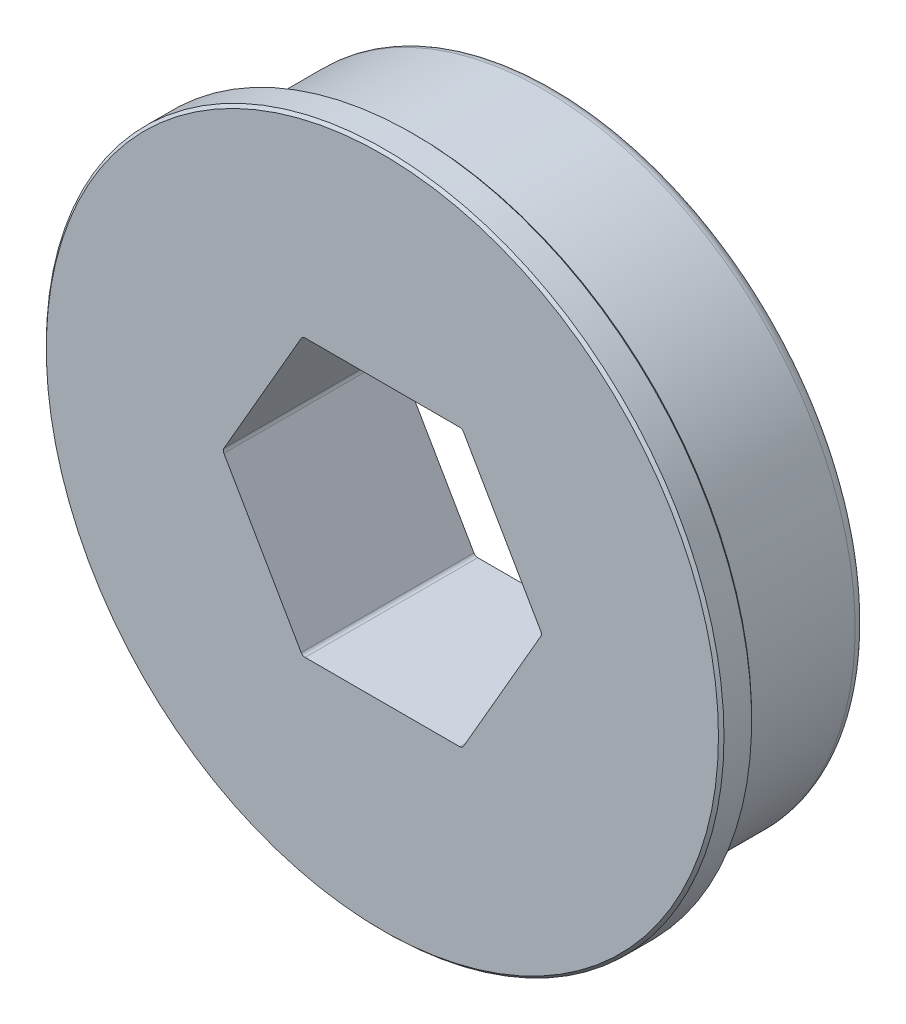
ISO-10303-21;
HEADER;
FILE_DESCRIPTION(('STEP AP214'),'2;1');
FILE_NAME('part.step','',(''),(''),'','','');
FILE_SCHEMA(('AUTOMOTIVE_DESIGN { 1 0 10303 214 1 1 1 1 }'));
ENDSEC;
DATA;
#1=APPLICATION_CONTEXT('core data for automotive mechanical design processes');
#2=APPLICATION_PROTOCOL_DEFINITION('international standard','automotive_design',2000,#1);
#3=PRODUCT_CONTEXT('',#1,'mechanical');
#4=PRODUCT('Part','Part','',(#3));
#5=PRODUCT_RELATED_PRODUCT_CATEGORY('part','',(#4));
#6=PRODUCT_DEFINITION_FORMATION('','',#4);
#7=PRODUCT_DEFINITION_CONTEXT('part definition',#1,'design');
#8=PRODUCT_DEFINITION('design','',#6,#7);
#9=PRODUCT_DEFINITION_SHAPE('','',#8);
#10=(LENGTH_UNIT() NAMED_UNIT(*) SI_UNIT(.MILLI.,.METRE.));
#11=(NAMED_UNIT(*) PLANE_ANGLE_UNIT() SI_UNIT($,.RADIAN.));
#12=(NAMED_UNIT(*) SI_UNIT($,.STERADIAN.) SOLID_ANGLE_UNIT());
#13=UNCERTAINTY_MEASURE_WITH_UNIT(LENGTH_MEASURE(1.E-05),#10,'distance_accuracy_value','');
#14=(GEOMETRIC_REPRESENTATION_CONTEXT(3) GLOBAL_UNCERTAINTY_ASSIGNED_CONTEXT((#13)) GLOBAL_UNIT_ASSIGNED_CONTEXT((#10,
#11,#12)) REPRESENTATION_CONTEXT('',''));
#15=CARTESIAN_POINT('',(0.,0.,0.));
#16=DIRECTION('',(0.,0.,1.));
#17=DIRECTION('',(1.,0.,0.));
#18=AXIS2_PLACEMENT_3D('',#15,#16,#17);
#19=CARTESIAN_POINT('',(0.,0.,7.92734));
#20=DIRECTION('',(0.,0.,-1.));
#21=DIRECTION('',(-1.,0.,0.));
#22=AXIS2_PLACEMENT_3D('',#19,#20,#21);
#23=CYLINDRICAL_SURFACE('',#22,15.5575);
#24=CARTESIAN_POINT('',(0.,0.,7.80034));
#25=DIRECTION('',(0.,0.,1.));
#26=DIRECTION('',(1.,0.,0.));
#27=AXIS2_PLACEMENT_3D('',#24,#25,#26);
#28=CIRCLE('',#27,15.5575);
#29=CARTESIAN_POINT('',(15.5575,0.,7.80034));
#30=VERTEX_POINT('',#29);
#31=EDGE_CURVE('E186',#30,#30,#28,.F.);
#32=ORIENTED_EDGE('',*,*,#31,.T.);
#33=EDGE_LOOP('',(#32));
#34=FACE_BOUND('',#33,.T.);
#35=CARTESIAN_POINT('',(0.,0.,6.53034000000001));
#36=DIRECTION('',(0.,0.,-1.));
#37=DIRECTION('',(-1.,0.,0.));
#38=AXIS2_PLACEMENT_3D('',#35,#36,#37);
#39=CIRCLE('',#38,15.5575);
#40=CARTESIAN_POINT('',(-15.5575,0.,6.53034000000001));
#41=VERTEX_POINT('',#40);
#42=EDGE_CURVE('E183',#41,#41,#39,.F.);
#43=ORIENTED_EDGE('',*,*,#42,.T.);
#44=EDGE_LOOP('',(#43));
#45=FACE_BOUND('',#44,.T.);
#46=ADVANCED_FACE('F36',(#34,#45),#23,.T.);
#47=CARTESIAN_POINT('',(15.5575,0.,7.92734));
#48=DIRECTION('',(0.,0.,1.));
#49=DIRECTION('',(1.,0.,0.));
#50=AXIS2_PLACEMENT_3D('',#47,#48,#49);
#51=PLANE('',#50);
#52=CARTESIAN_POINT('',(0.,0.,7.92734));
#53=DIRECTION('',(0.,0.,1.));
#54=DIRECTION('',(1.,0.,0.));
#55=AXIS2_PLACEMENT_3D('',#52,#53,#54);
#56=CIRCLE('',#55,15.4305);
#57=CARTESIAN_POINT('',(15.4305,0.,7.92734));
#58=VERTEX_POINT('',#57);
#59=EDGE_CURVE('E189',#58,#58,#56,.T.);
#60=ORIENTED_EDGE('',*,*,#59,.T.);
#61=EDGE_LOOP('',(#60));
#62=FACE_BOUND('',#61,.T.);
#63=DIRECTION('',(-0.5,0.866025403784438,0.));
#64=VECTOR('',#63,1.);
#65=CARTESIAN_POINT('',(-3.66617420935411,-6.35000000000001,7.92734));
#66=LINE('',#65,#64);
#67=CARTESIAN_POINT('',(-3.72483299670378,-6.24840000000001,7.92734));
#68=VERTEX_POINT('',#67);
#69=CARTESIAN_POINT('',(-7.27368963135857,-0.101600000000006,7.92734));
#70=VERTEX_POINT('',#69);
#71=EDGE_CURVE('E174',#68,#70,#66,.T.);
#72=ORIENTED_EDGE('',*,*,#71,.T.);
#73=CARTESIAN_POINT('',(-7.09771326930958,0.,7.92734));
#74=DIRECTION('',(0.,0.,1.));
#75=DIRECTION('',(1.,0.,0.));
#76=AXIS2_PLACEMENT_3D('',#73,#74,#75);
#77=CIRCLE('',#76,0.2032);
#78=CARTESIAN_POINT('',(-7.27368963135857,0.101599999999993,7.92734));
#79=VERTEX_POINT('',#78);
#80=EDGE_CURVE('E58',#70,#79,#77,.F.);
#81=ORIENTED_EDGE('',*,*,#80,.T.);
#82=DIRECTION('',(0.5,0.866025403784439,0.));
#83=VECTOR('',#82,1.);
#84=CARTESIAN_POINT('',(-7.33234841870824,0.,7.92734));
#85=LINE('',#84,#83);
#86=CARTESIAN_POINT('',(-3.72483299670379,6.24839999999999,7.92734));
#87=VERTEX_POINT('',#86);
#88=EDGE_CURVE('E169',#79,#87,#85,.T.);
#89=ORIENTED_EDGE('',*,*,#88,.T.);
#90=CARTESIAN_POINT('',(-3.54885663465479,6.14679999999999,7.92734));
#91=DIRECTION('',(0.,0.,1.));
#92=DIRECTION('',(1.,0.,0.));
#93=AXIS2_PLACEMENT_3D('',#90,#91,#92);
#94=CIRCLE('',#93,0.2032);
#95=CARTESIAN_POINT('',(-3.54885663465479,6.34999999999999,7.92734));
#96=VERTEX_POINT('',#95);
#97=EDGE_CURVE('E11',#87,#96,#94,.F.);
#98=ORIENTED_EDGE('',*,*,#97,.T.);
#99=DIRECTION('',(1.,0.,0.));
#100=VECTOR('',#99,1.);
#101=CARTESIAN_POINT('',(-3.66617420935412,6.34999999999999,7.92734));
#102=LINE('',#101,#100);
#103=CARTESIAN_POINT('',(3.5488566346548,6.35,7.92734));
#104=VERTEX_POINT('',#103);
#105=EDGE_CURVE('E242',#96,#104,#102,.T.);
#106=ORIENTED_EDGE('',*,*,#105,.T.);
#107=CARTESIAN_POINT('',(3.5488566346548,6.1468,7.92734));
#108=DIRECTION('',(0.,0.,1.));
#109=DIRECTION('',(1.,0.,0.));
#110=AXIS2_PLACEMENT_3D('',#107,#108,#109);
#111=CIRCLE('',#110,0.2032);
#112=CARTESIAN_POINT('',(3.72483299670379,6.2484,7.92734));
#113=VERTEX_POINT('',#112);
#114=EDGE_CURVE('E136',#104,#113,#111,.F.);
#115=ORIENTED_EDGE('',*,*,#114,.T.);
#116=DIRECTION('',(0.5,-0.866025403784438,0.));
#117=VECTOR('',#116,1.);
#118=CARTESIAN_POINT('',(3.66617420935413,6.35,7.92734));
#119=LINE('',#118,#117);
#120=CARTESIAN_POINT('',(7.27368963135859,0.101599999999997,7.92734));
#121=VERTEX_POINT('',#120);
#122=EDGE_CURVE('E146',#113,#121,#119,.T.);
#123=ORIENTED_EDGE('',*,*,#122,.T.);
#124=CARTESIAN_POINT('',(7.09771326930959,0.,7.92734));
#125=DIRECTION('',(0.,0.,1.));
#126=DIRECTION('',(1.,0.,0.));
#127=AXIS2_PLACEMENT_3D('',#124,#125,#126);
#128=CIRCLE('',#127,0.2032);
#129=CARTESIAN_POINT('',(7.27368963135859,-0.101600000000005,7.92734));
#130=VERTEX_POINT('',#129);
#131=EDGE_CURVE('E222',#121,#130,#128,.F.);
#132=ORIENTED_EDGE('',*,*,#131,.T.);
#133=DIRECTION('',(-0.5,-0.866025403784439,0.));
#134=VECTOR('',#133,1.);
#135=CARTESIAN_POINT('',(7.33234841870825,0.,7.92734));
#136=LINE('',#135,#134);
#137=CARTESIAN_POINT('',(3.7248329967038,-6.24840000000001,7.92734));
#138=VERTEX_POINT('',#137);
#139=EDGE_CURVE('E246',#130,#138,#136,.T.);
#140=ORIENTED_EDGE('',*,*,#139,.T.);
#141=CARTESIAN_POINT('',(3.5488566346548,-6.14680000000001,7.92734));
#142=DIRECTION('',(0.,0.,1.));
#143=DIRECTION('',(1.,0.,0.));
#144=AXIS2_PLACEMENT_3D('',#141,#142,#143);
#145=CIRCLE('',#144,0.2032);
#146=CARTESIAN_POINT('',(3.5488566346548,-6.35000000000001,7.92734));
#147=VERTEX_POINT('',#146);
#148=EDGE_CURVE('E226',#138,#147,#145,.F.);
#149=ORIENTED_EDGE('',*,*,#148,.T.);
#150=DIRECTION('',(-1.,0.,0.));
#151=VECTOR('',#150,1.);
#152=CARTESIAN_POINT('',(3.66617420935413,-6.35000000000001,7.92734));
#153=LINE('',#152,#151);
#154=CARTESIAN_POINT('',(-3.54885663465478,-6.35000000000001,7.92734));
#155=VERTEX_POINT('',#154);
#156=EDGE_CURVE('E252',#147,#155,#153,.T.);
#157=ORIENTED_EDGE('',*,*,#156,.T.);
#158=CARTESIAN_POINT('',(-3.54885663465478,-6.14680000000001,7.92734));
#159=DIRECTION('',(0.,0.,1.));
#160=DIRECTION('',(1.,0.,0.));
#161=AXIS2_PLACEMENT_3D('',#158,#159,#160);
#162=CIRCLE('',#161,0.2032);
#163=EDGE_CURVE('E230',#155,#68,#162,.F.);
#164=ORIENTED_EDGE('',*,*,#163,.T.);
#165=EDGE_LOOP('',(#72,#81,#89,#98,#106,#115,#123,#132,#140,#149,#157,#164));
#166=FACE_BOUND('',#165,.T.);
#167=ADVANCED_FACE('F241',(#62,#166),#51,.T.);
#168=CARTESIAN_POINT('',(0.,0.,0.));
#169=DIRECTION('',(0.,0.,-1.));
#170=DIRECTION('',(-1.,0.,0.));
#171=AXIS2_PLACEMENT_3D('',#168,#169,#170);
#172=PLANE('',#171);
#173=CARTESIAN_POINT('',(0.,0.,0.));
#174=DIRECTION('',(0.,0.,-1.));
#175=DIRECTION('',(-1.,0.,0.));
#176=AXIS2_PLACEMENT_3D('',#173,#174,#175);
#177=CIRCLE('',#176,13.7795);
#178=CARTESIAN_POINT('',(-13.7795,0.,0.));
#179=VERTEX_POINT('',#178);
#180=EDGE_CURVE('E192',#179,#179,#177,.T.);
#181=ORIENTED_EDGE('',*,*,#180,.T.);
#182=EDGE_LOOP('',(#181));
#183=FACE_BOUND('',#182,.T.);
#184=DIRECTION('',(0.5,0.866025403784439,0.));
#185=VECTOR('',#184,1.);
#186=CARTESIAN_POINT('',(-7.33234841870824,0.,0.));
#187=LINE('',#186,#185);
#188=CARTESIAN_POINT('',(-7.27368963135857,0.101599999999993,0.));
#189=VERTEX_POINT('',#188);
#190=CARTESIAN_POINT('',(-3.72483299670379,6.24839999999999,0.));
#191=VERTEX_POINT('',#190);
#192=EDGE_CURVE('E160',#189,#191,#187,.T.);
#193=ORIENTED_EDGE('',*,*,#192,.F.);
#194=CARTESIAN_POINT('',(-7.09771326930958,0.,0.));
#195=DIRECTION('',(0.,0.,-1.));
#196=DIRECTION('',(-1.,0.,0.));
#197=AXIS2_PLACEMENT_3D('',#194,#195,#196);
#198=CIRCLE('',#197,0.2032);
#199=CARTESIAN_POINT('',(-7.27368963135857,-0.101600000000006,0.));
#200=VERTEX_POINT('',#199);
#201=EDGE_CURVE('E232',#189,#200,#198,.F.);
#202=ORIENTED_EDGE('',*,*,#201,.T.);
#203=DIRECTION('',(-0.5,0.866025403784438,0.));
#204=VECTOR('',#203,1.);
#205=CARTESIAN_POINT('',(-3.66617420935411,-6.35000000000001,0.));
#206=LINE('',#205,#204);
#207=CARTESIAN_POINT('',(-3.72483299670378,-6.24840000000001,0.));
#208=VERTEX_POINT('',#207);
#209=EDGE_CURVE('E166',#208,#200,#206,.T.);
#210=ORIENTED_EDGE('',*,*,#209,.F.);
#211=CARTESIAN_POINT('',(-3.54885663465478,-6.14680000000001,0.));
#212=DIRECTION('',(0.,0.,-1.));
#213=DIRECTION('',(-1.,0.,0.));
#214=AXIS2_PLACEMENT_3D('',#211,#212,#213);
#215=CIRCLE('',#214,0.2032);
#216=CARTESIAN_POINT('',(-3.54885663465478,-6.35000000000001,0.));
#217=VERTEX_POINT('',#216);
#218=EDGE_CURVE('E228',#208,#217,#215,.F.);
#219=ORIENTED_EDGE('',*,*,#218,.T.);
#220=DIRECTION('',(-1.,0.,0.));
#221=VECTOR('',#220,1.);
#222=CARTESIAN_POINT('',(3.66617420935413,-6.35000000000001,0.));
#223=LINE('',#222,#221);
#224=CARTESIAN_POINT('',(3.5488566346548,-6.35000000000001,0.));
#225=VERTEX_POINT('',#224);
#226=EDGE_CURVE('E158',#225,#217,#223,.T.);
#227=ORIENTED_EDGE('',*,*,#226,.F.);
#228=CARTESIAN_POINT('',(3.5488566346548,-6.14680000000001,0.));
#229=DIRECTION('',(0.,0.,-1.));
#230=DIRECTION('',(-1.,0.,0.));
#231=AXIS2_PLACEMENT_3D('',#228,#229,#230);
#232=CIRCLE('',#231,0.2032);
#233=CARTESIAN_POINT('',(3.7248329967038,-6.24840000000001,0.));
#234=VERTEX_POINT('',#233);
#235=EDGE_CURVE('E224',#225,#234,#232,.F.);
#236=ORIENTED_EDGE('',*,*,#235,.T.);
#237=DIRECTION('',(-0.5,-0.866025403784439,0.));
#238=VECTOR('',#237,1.);
#239=CARTESIAN_POINT('',(7.33234841870825,0.,0.));
#240=LINE('',#239,#238);
#241=CARTESIAN_POINT('',(7.27368963135859,-0.101600000000005,0.));
#242=VERTEX_POINT('',#241);
#243=EDGE_CURVE('E154',#242,#234,#240,.T.);
#244=ORIENTED_EDGE('',*,*,#243,.F.);
#245=CARTESIAN_POINT('',(7.09771326930959,0.,0.));
#246=DIRECTION('',(0.,0.,-1.));
#247=DIRECTION('',(-1.,0.,0.));
#248=AXIS2_PLACEMENT_3D('',#245,#246,#247);
#249=CIRCLE('',#248,0.2032);
#250=CARTESIAN_POINT('',(7.27368963135859,0.101599999999997,0.));
#251=VERTEX_POINT('',#250);
#252=EDGE_CURVE('E153',#242,#251,#249,.F.);
#253=ORIENTED_EDGE('',*,*,#252,.T.);
#254=DIRECTION('',(0.5,-0.866025403784438,0.));
#255=VECTOR('',#254,1.);
#256=CARTESIAN_POINT('',(3.66617420935413,6.35,0.));
#257=LINE('',#256,#255);
#258=CARTESIAN_POINT('',(3.72483299670379,6.2484,0.));
#259=VERTEX_POINT('',#258);
#260=EDGE_CURVE('E143',#259,#251,#257,.T.);
#261=ORIENTED_EDGE('',*,*,#260,.F.);
#262=CARTESIAN_POINT('',(3.5488566346548,6.1468,0.));
#263=DIRECTION('',(0.,0.,-1.));
#264=DIRECTION('',(-1.,0.,0.));
#265=AXIS2_PLACEMENT_3D('',#262,#263,#264);
#266=CIRCLE('',#265,0.2032);
#267=CARTESIAN_POINT('',(3.5488566346548,6.35,0.));
#268=VERTEX_POINT('',#267);
#269=EDGE_CURVE('E126',#259,#268,#266,.F.);
#270=ORIENTED_EDGE('',*,*,#269,.T.);
#271=DIRECTION('',(1.,0.,0.));
#272=VECTOR('',#271,1.);
#273=CARTESIAN_POINT('',(-3.66617420935412,6.34999999999999,0.));
#274=LINE('',#273,#272);
#275=CARTESIAN_POINT('',(-3.54885663465479,6.34999999999999,0.));
#276=VERTEX_POINT('',#275);
#277=EDGE_CURVE('E155',#276,#268,#274,.T.);
#278=ORIENTED_EDGE('',*,*,#277,.F.);
#279=CARTESIAN_POINT('',(-3.54885663465479,6.14679999999999,0.));
#280=DIRECTION('',(0.,0.,-1.));
#281=DIRECTION('',(-1.,0.,0.));
#282=AXIS2_PLACEMENT_3D('',#279,#280,#281);
#283=CIRCLE('',#282,0.2032);
#284=EDGE_CURVE('E44',#276,#191,#283,.F.);
#285=ORIENTED_EDGE('',*,*,#284,.T.);
#286=EDGE_LOOP('',(#193,#202,#210,#219,#227,#236,#244,#253,#261,#270,#278,#285));
#287=FACE_BOUND('',#286,.T.);
#288=ADVANCED_FACE('F151',(#183,#287),#172,.T.);
#289=CARTESIAN_POINT('',(0.,0.,7.92734));
#290=DIRECTION('',(0.,0.,-1.));
#291=DIRECTION('',(-1.,0.,0.));
#292=AXIS2_PLACEMENT_3D('',#289,#290,#291);
#293=CYLINDRICAL_SURFACE('',#292,14.2875);
#294=CARTESIAN_POINT('',(0.,0.,0.508));
#295=DIRECTION('',(0.,0.,-1.));
#296=DIRECTION('',(-1.,0.,0.));
#297=AXIS2_PLACEMENT_3D('',#294,#295,#296);
#298=CIRCLE('',#297,14.2875);
#299=CARTESIAN_POINT('',(-14.2875,0.,0.508));
#300=VERTEX_POINT('',#299);
#301=EDGE_CURVE('E195',#300,#300,#298,.F.);
#302=ORIENTED_EDGE('',*,*,#301,.T.);
#303=EDGE_LOOP('',(#302));
#304=FACE_BOUND('',#303,.T.);
#305=CARTESIAN_POINT('',(0.,0.,5.89534));
#306=DIRECTION('',(0.,0.,-1.));
#307=DIRECTION('',(-1.,0.,0.));
#308=AXIS2_PLACEMENT_3D('',#305,#306,#307);
#309=CIRCLE('',#308,14.2875);
#310=CARTESIAN_POINT('',(-14.2875,0.,5.89534));
#311=VERTEX_POINT('',#310);
#312=EDGE_CURVE('E177',#311,#311,#309,.T.);
#313=ORIENTED_EDGE('',*,*,#312,.T.);
#314=EDGE_LOOP('',(#313));
#315=FACE_BOUND('',#314,.T.);
#316=ADVANCED_FACE('F320',(#304,#315),#293,.T.);
#317=CARTESIAN_POINT('',(14.2875,0.,5.89534));
#318=DIRECTION('',(0.,0.,1.));
#319=DIRECTION('',(1.,0.,0.));
#320=AXIS2_PLACEMENT_3D('',#317,#318,#319);
#321=PLANE('',#320);
#322=CARTESIAN_POINT('',(0.,0.,5.89534));
#323=DIRECTION('',(0.,0.,-1.));
#324=DIRECTION('',(-1.,0.,0.));
#325=AXIS2_PLACEMENT_3D('',#322,#323,#324);
#326=CIRCLE('',#325,13.97);
#327=CARTESIAN_POINT('',(-13.97,0.,5.89534));
#328=VERTEX_POINT('',#327);
#329=EDGE_CURVE('E173',#328,#328,#326,.T.);
#330=ORIENTED_EDGE('',*,*,#329,.T.);
#331=EDGE_LOOP('',(#330));
#332=FACE_BOUND('',#331,.T.);
#333=ORIENTED_EDGE('',*,*,#312,.F.);
#334=EDGE_LOOP('',(#333));
#335=FACE_BOUND('',#334,.T.);
#336=ADVANCED_FACE('F324',(#332,#335),#321,.T.);
#337=CARTESIAN_POINT('',(0.,0.,7.92734));
#338=DIRECTION('',(0.,0.,-1.));
#339=DIRECTION('',(-1.,0.,0.));
#340=AXIS2_PLACEMENT_3D('',#337,#338,#339);
#341=CYLINDRICAL_SURFACE('',#340,13.97);
#342=CARTESIAN_POINT('',(0.,0.,6.40333999999999));
#343=DIRECTION('',(0.,0.,-1.));
#344=DIRECTION('',(-1.,0.,0.));
#345=AXIS2_PLACEMENT_3D('',#342,#343,#344);
#346=CIRCLE('',#345,13.97);
#347=CARTESIAN_POINT('',(-13.97,0.,6.40333999999999));
#348=VERTEX_POINT('',#347);
#349=EDGE_CURVE('E170',#348,#348,#346,.T.);
#350=ORIENTED_EDGE('',*,*,#349,.T.);
#351=EDGE_LOOP('',(#350));
#352=FACE_BOUND('',#351,.T.);
#353=ORIENTED_EDGE('',*,*,#329,.F.);
#354=EDGE_LOOP('',(#353));
#355=FACE_BOUND('',#354,.T.);
#356=ADVANCED_FACE('F330',(#352,#355),#341,.T.);
#357=CARTESIAN_POINT('',(13.97,0.,6.40334));
#358=DIRECTION('',(0.,0.,-1.));
#359=DIRECTION('',(-1.,0.,0.));
#360=AXIS2_PLACEMENT_3D('',#357,#358,#359);
#361=PLANE('',#360);
#362=CARTESIAN_POINT('',(0.,0.,6.40334));
#363=DIRECTION('',(0.,0.,-1.));
#364=DIRECTION('',(-1.,0.,0.));
#365=AXIS2_PLACEMENT_3D('',#362,#363,#364);
#366=CIRCLE('',#365,15.4305);
#367=CARTESIAN_POINT('',(-15.4305,0.,6.40334));
#368=VERTEX_POINT('',#367);
#369=EDGE_CURVE('E180',#368,#368,#366,.T.);
#370=ORIENTED_EDGE('',*,*,#369,.T.);
#371=EDGE_LOOP('',(#370));
#372=FACE_BOUND('',#371,.T.);
#373=ORIENTED_EDGE('',*,*,#349,.F.);
#374=EDGE_LOOP('',(#373));
#375=FACE_BOUND('',#374,.T.);
#376=ADVANCED_FACE('F334',(#372,#375),#361,.T.);
#377=CARTESIAN_POINT('',(-7.33234841870824,0.,7.92734));
#378=DIRECTION('',(-0.866025403784439,0.5,0.));
#379=DIRECTION('',(-0.5,-0.866025403784439,0.));
#380=AXIS2_PLACEMENT_3D('',#377,#378,#379);
#381=PLANE('',#380);
#382=ORIENTED_EDGE('',*,*,#88,.F.);
#383=DIRECTION('',(0.,0.,-1.));
#384=VECTOR('',#383,1.);
#385=CARTESIAN_POINT('',(-7.27368963135857,0.101599999999994,0.));
#386=LINE('',#385,#384);
#387=EDGE_CURVE('E137',#79,#189,#386,.T.);
#388=ORIENTED_EDGE('',*,*,#387,.T.);
#389=ORIENTED_EDGE('',*,*,#192,.T.);
#390=DIRECTION('',(0.,0.,-1.));
#391=VECTOR('',#390,1.);
#392=CARTESIAN_POINT('',(-3.72483299670378,6.24839999999999,7.92734));
#393=LINE('',#392,#391);
#394=EDGE_CURVE('E51',#191,#87,#393,.F.);
#395=ORIENTED_EDGE('',*,*,#394,.T.);
#396=EDGE_LOOP('',(#382,#388,#389,#395));
#397=FACE_BOUND('',#396,.T.);
#398=ADVANCED_FACE('F236',(#397),#381,.F.);
#399=CARTESIAN_POINT('',(-3.66617420935411,-6.35000000000001,7.92734));
#400=DIRECTION('',(-0.866025403784438,-0.5,0.));
#401=DIRECTION('',(0.5,-0.866025403784439,0.));
#402=AXIS2_PLACEMENT_3D('',#399,#400,#401);
#403=PLANE('',#402);
#404=ORIENTED_EDGE('',*,*,#71,.F.);
#405=DIRECTION('',(0.,0.,-1.));
#406=VECTOR('',#405,1.);
#407=CARTESIAN_POINT('',(-3.72483299670378,-6.24840000000001,0.));
#408=LINE('',#407,#406);
#409=EDGE_CURVE('E214',#68,#208,#408,.T.);
#410=ORIENTED_EDGE('',*,*,#409,.T.);
#411=ORIENTED_EDGE('',*,*,#209,.T.);
#412=DIRECTION('',(0.,0.,-1.));
#413=VECTOR('',#412,1.);
#414=CARTESIAN_POINT('',(-7.27368963135857,-0.101600000000006,7.92734));
#415=LINE('',#414,#413);
#416=EDGE_CURVE('E212',#200,#70,#415,.F.);
#417=ORIENTED_EDGE('',*,*,#416,.T.);
#418=EDGE_LOOP('',(#404,#410,#411,#417));
#419=FACE_BOUND('',#418,.T.);
#420=ADVANCED_FACE('F263',(#419),#403,.F.);
#421=CARTESIAN_POINT('',(3.66617420935413,-6.35000000000001,7.92734));
#422=DIRECTION('',(0.,-1.,0.));
#423=DIRECTION('',(0.,0.,-1.));
#424=AXIS2_PLACEMENT_3D('',#421,#422,#423);
#425=PLANE('',#424);
#426=ORIENTED_EDGE('',*,*,#156,.F.);
#427=DIRECTION('',(0.,0.,-1.));
#428=VECTOR('',#427,1.);
#429=CARTESIAN_POINT('',(3.5488566346548,-6.35000000000001,0.));
#430=LINE('',#429,#428);
#431=EDGE_CURVE('E209',#147,#225,#430,.T.);
#432=ORIENTED_EDGE('',*,*,#431,.T.);
#433=ORIENTED_EDGE('',*,*,#226,.T.);
#434=DIRECTION('',(0.,0.,-1.));
#435=VECTOR('',#434,1.);
#436=CARTESIAN_POINT('',(-3.54885663465478,-6.35000000000001,7.92734));
#437=LINE('',#436,#435);
#438=EDGE_CURVE('E207',#217,#155,#437,.F.);
#439=ORIENTED_EDGE('',*,*,#438,.T.);
#440=EDGE_LOOP('',(#426,#432,#433,#439));
#441=FACE_BOUND('',#440,.T.);
#442=ADVANCED_FACE('F270',(#441),#425,.F.);
#443=CARTESIAN_POINT('',(7.33234841870825,0.,7.92734));
#444=DIRECTION('',(0.866025403784439,-0.5,0.));
#445=DIRECTION('',(0.5,0.866025403784439,0.));
#446=AXIS2_PLACEMENT_3D('',#443,#444,#445);
#447=PLANE('',#446);
#448=ORIENTED_EDGE('',*,*,#139,.F.);
#449=DIRECTION('',(0.,0.,-1.));
#450=VECTOR('',#449,1.);
#451=CARTESIAN_POINT('',(7.27368963135859,-0.101600000000005,0.));
#452=LINE('',#451,#450);
#453=EDGE_CURVE('E204',#130,#242,#452,.T.);
#454=ORIENTED_EDGE('',*,*,#453,.T.);
#455=ORIENTED_EDGE('',*,*,#243,.T.);
#456=DIRECTION('',(0.,0.,-1.));
#457=VECTOR('',#456,1.);
#458=CARTESIAN_POINT('',(3.7248329967038,-6.24840000000001,7.92734));
#459=LINE('',#458,#457);
#460=EDGE_CURVE('E202',#234,#138,#459,.F.);
#461=ORIENTED_EDGE('',*,*,#460,.T.);
#462=EDGE_LOOP('',(#448,#454,#455,#461));
#463=FACE_BOUND('',#462,.T.);
#464=ADVANCED_FACE('F278',(#463),#447,.F.);
#465=CARTESIAN_POINT('',(3.66617420935413,6.35,7.92734));
#466=DIRECTION('',(0.866025403784439,0.5,0.));
#467=DIRECTION('',(-0.5,0.866025403784439,0.));
#468=AXIS2_PLACEMENT_3D('',#465,#466,#467);
#469=PLANE('',#468);
#470=ORIENTED_EDGE('',*,*,#122,.F.);
#471=DIRECTION('',(0.,0.,-1.));
#472=VECTOR('',#471,1.);
#473=CARTESIAN_POINT('',(3.72483299670379,6.2484,0.));
#474=LINE('',#473,#472);
#475=EDGE_CURVE('E130',#113,#259,#474,.T.);
#476=ORIENTED_EDGE('',*,*,#475,.T.);
#477=ORIENTED_EDGE('',*,*,#260,.T.);
#478=DIRECTION('',(0.,0.,-1.));
#479=VECTOR('',#478,1.);
#480=CARTESIAN_POINT('',(7.27368963135859,0.101599999999995,7.92734));
#481=LINE('',#480,#479);
#482=EDGE_CURVE('E148',#251,#121,#481,.F.);
#483=ORIENTED_EDGE('',*,*,#482,.T.);
#484=EDGE_LOOP('',(#470,#476,#477,#483));
#485=FACE_BOUND('',#484,.T.);
#486=ADVANCED_FACE('F142',(#485),#469,.F.);
#487=CARTESIAN_POINT('',(-3.66617420935412,6.34999999999999,7.92734));
#488=DIRECTION('',(0.,1.,0.));
#489=DIRECTION('',(-1.,0.,0.));
#490=AXIS2_PLACEMENT_3D('',#487,#488,#489);
#491=PLANE('',#490);
#492=ORIENTED_EDGE('',*,*,#277,.T.);
#493=DIRECTION('',(0.,0.,-1.));
#494=VECTOR('',#493,1.);
#495=CARTESIAN_POINT('',(3.5488566346548,6.35,7.92734));
#496=LINE('',#495,#494);
#497=EDGE_CURVE('E131',#268,#104,#496,.F.);
#498=ORIENTED_EDGE('',*,*,#497,.T.);
#499=ORIENTED_EDGE('',*,*,#105,.F.);
#500=DIRECTION('',(0.,0.,-1.));
#501=VECTOR('',#500,1.);
#502=CARTESIAN_POINT('',(-3.54885663465479,6.34999999999999,0.));
#503=LINE('',#502,#501);
#504=EDGE_CURVE('E147',#96,#276,#503,.T.);
#505=ORIENTED_EDGE('',*,*,#504,.T.);
#506=EDGE_LOOP('',(#492,#498,#499,#505));
#507=FACE_BOUND('',#506,.T.);
#508=ADVANCED_FACE('F244',(#507),#491,.F.);
#509=CARTESIAN_POINT('',(0.,0.,6.40334));
#510=DIRECTION('',(0.,0.,1.));
#511=DIRECTION('',(1.,0.,0.));
#512=AXIS2_PLACEMENT_3D('',#509,#510,#511);
#513=CONICAL_SURFACE('',#512,15.4305,0.785398163397469);
#514=ORIENTED_EDGE('',*,*,#42,.F.);
#515=EDGE_LOOP('',(#514));
#516=FACE_BOUND('',#515,.T.);
#517=ORIENTED_EDGE('',*,*,#369,.F.);
#518=EDGE_LOOP('',(#517));
#519=FACE_BOUND('',#518,.T.);
#520=ADVANCED_FACE('F303',(#516,#519),#513,.T.);
#521=CARTESIAN_POINT('',(0.,0.,7.80034));
#522=DIRECTION('',(0.,0.,-1.));
#523=DIRECTION('',(-1.,0.,0.));
#524=AXIS2_PLACEMENT_3D('',#521,#522,#523);
#525=CONICAL_SURFACE('',#524,15.5575,0.785398163397442);
#526=ORIENTED_EDGE('',*,*,#59,.F.);
#527=EDGE_LOOP('',(#526));
#528=FACE_BOUND('',#527,.T.);
#529=ORIENTED_EDGE('',*,*,#31,.F.);
#530=EDGE_LOOP('',(#529));
#531=FACE_BOUND('',#530,.T.);
#532=ADVANCED_FACE('F306',(#528,#531),#525,.T.);
#533=CARTESIAN_POINT('',(0.,0.,0.508));
#534=DIRECTION('',(0.,0.,-1.));
#535=DIRECTION('',(-1.,0.,0.));
#536=AXIS2_PLACEMENT_3D('',#533,#534,#535);
#537=TOROIDAL_SURFACE('',#536,13.7795,0.508);
#538=ORIENTED_EDGE('',*,*,#301,.F.);
#539=EDGE_LOOP('',(#538));
#540=FACE_BOUND('',#539,.T.);
#541=ORIENTED_EDGE('',*,*,#180,.F.);
#542=EDGE_LOOP('',(#541));
#543=FACE_BOUND('',#542,.T.);
#544=ADVANCED_FACE('F290',(#540,#543),#537,.T.);
#545=CARTESIAN_POINT('',(3.5488566346548,6.1468,7.92734));
#546=DIRECTION('',(0.,0.,1.));
#547=DIRECTION('',(1.,0.,0.));
#548=AXIS2_PLACEMENT_3D('',#545,#546,#547);
#549=CYLINDRICAL_SURFACE('',#548,0.2032);
#550=ORIENTED_EDGE('',*,*,#114,.F.);
#551=ORIENTED_EDGE('',*,*,#497,.F.);
#552=ORIENTED_EDGE('',*,*,#269,.F.);
#553=ORIENTED_EDGE('',*,*,#475,.F.);
#554=EDGE_LOOP('',(#550,#551,#552,#553));
#555=FACE_BOUND('',#554,.T.);
#556=ADVANCED_FACE('F129',(#555),#549,.F.);
#557=CARTESIAN_POINT('',(7.09771326930959,0.,7.92734));
#558=DIRECTION('',(0.,0.,1.));
#559=DIRECTION('',(1.,0.,0.));
#560=AXIS2_PLACEMENT_3D('',#557,#558,#559);
#561=CYLINDRICAL_SURFACE('',#560,0.2032);
#562=ORIENTED_EDGE('',*,*,#131,.F.);
#563=ORIENTED_EDGE('',*,*,#482,.F.);
#564=ORIENTED_EDGE('',*,*,#252,.F.);
#565=ORIENTED_EDGE('',*,*,#453,.F.);
#566=EDGE_LOOP('',(#562,#563,#564,#565));
#567=FACE_BOUND('',#566,.T.);
#568=ADVANCED_FACE('F282',(#567),#561,.F.);
#569=CARTESIAN_POINT('',(3.5488566346548,-6.14680000000001,7.92734));
#570=DIRECTION('',(0.,0.,1.));
#571=DIRECTION('',(1.,0.,0.));
#572=AXIS2_PLACEMENT_3D('',#569,#570,#571);
#573=CYLINDRICAL_SURFACE('',#572,0.2032);
#574=ORIENTED_EDGE('',*,*,#148,.F.);
#575=ORIENTED_EDGE('',*,*,#460,.F.);
#576=ORIENTED_EDGE('',*,*,#235,.F.);
#577=ORIENTED_EDGE('',*,*,#431,.F.);
#578=EDGE_LOOP('',(#574,#575,#576,#577));
#579=FACE_BOUND('',#578,.T.);
#580=ADVANCED_FACE('F274',(#579),#573,.F.);
#581=CARTESIAN_POINT('',(-3.54885663465478,-6.14680000000001,7.92734));
#582=DIRECTION('',(0.,0.,1.));
#583=DIRECTION('',(1.,0.,0.));
#584=AXIS2_PLACEMENT_3D('',#581,#582,#583);
#585=CYLINDRICAL_SURFACE('',#584,0.2032);
#586=ORIENTED_EDGE('',*,*,#163,.F.);
#587=ORIENTED_EDGE('',*,*,#438,.F.);
#588=ORIENTED_EDGE('',*,*,#218,.F.);
#589=ORIENTED_EDGE('',*,*,#409,.F.);
#590=EDGE_LOOP('',(#586,#587,#588,#589));
#591=FACE_BOUND('',#590,.T.);
#592=ADVANCED_FACE('F265',(#591),#585,.F.);
#593=CARTESIAN_POINT('',(-7.09771326930958,0.,7.92734));
#594=DIRECTION('',(0.,0.,1.));
#595=DIRECTION('',(1.,0.,0.));
#596=AXIS2_PLACEMENT_3D('',#593,#594,#595);
#597=CYLINDRICAL_SURFACE('',#596,0.2032);
#598=ORIENTED_EDGE('',*,*,#80,.F.);
#599=ORIENTED_EDGE('',*,*,#416,.F.);
#600=ORIENTED_EDGE('',*,*,#201,.F.);
#601=ORIENTED_EDGE('',*,*,#387,.F.);
#602=EDGE_LOOP('',(#598,#599,#600,#601));
#603=FACE_BOUND('',#602,.T.);
#604=ADVANCED_FACE('F261',(#603),#597,.F.);
#605=CARTESIAN_POINT('',(-3.54885663465479,6.14679999999999,7.92734));
#606=DIRECTION('',(0.,0.,1.));
#607=DIRECTION('',(1.,0.,0.));
#608=AXIS2_PLACEMENT_3D('',#605,#606,#607);
#609=CYLINDRICAL_SURFACE('',#608,0.2032);
#610=ORIENTED_EDGE('',*,*,#97,.F.);
#611=ORIENTED_EDGE('',*,*,#394,.F.);
#612=ORIENTED_EDGE('',*,*,#284,.F.);
#613=ORIENTED_EDGE('',*,*,#504,.F.);
#614=EDGE_LOOP('',(#610,#611,#612,#613));
#615=FACE_BOUND('',#614,.T.);
#616=ADVANCED_FACE('F38',(#615),#609,.F.);
#617=CLOSED_SHELL('',(#46,#167,#288,#316,#336,#356,#376,#398,#420,#442,#464,#486,#508,#520,#532,
#544,#556,#568,#580,#592,#604,#616));
#618=MANIFOLD_SOLID_BREP('B2',#617);
#619=ADVANCED_BREP_SHAPE_REPRESENTATION('',(#18,#618),#14);
#620=SHAPE_DEFINITION_REPRESENTATION(#9,#619);
ENDSEC;
END-ISO-10303-21;
